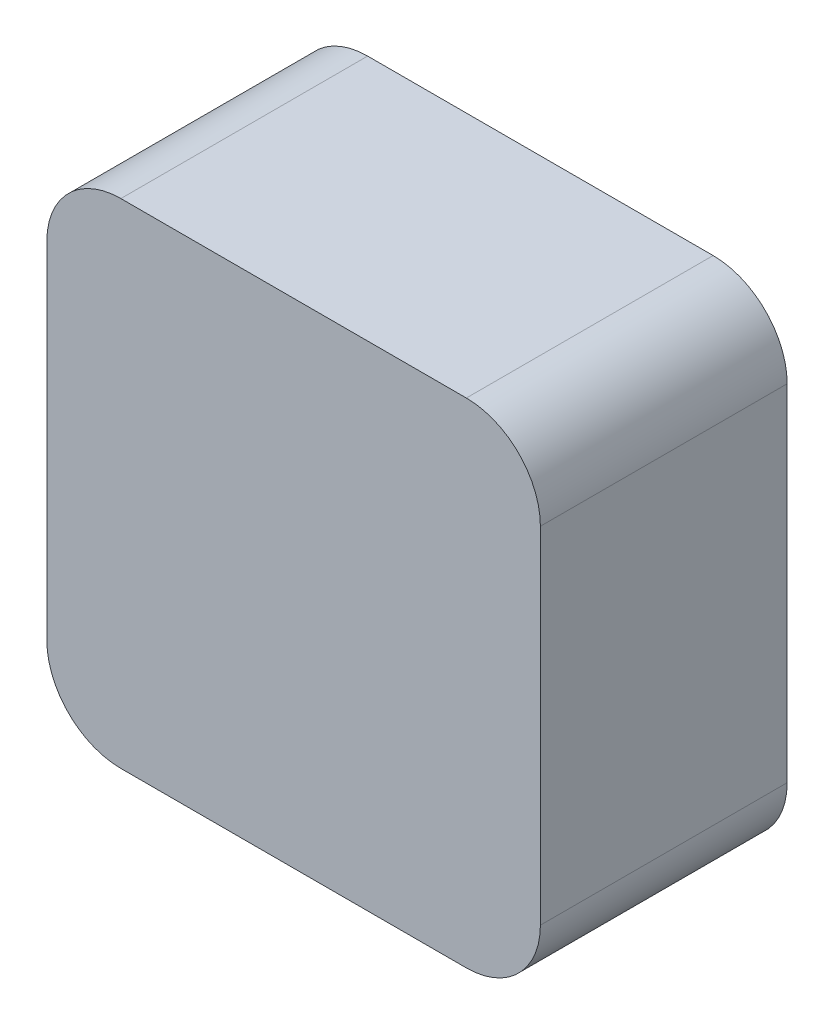
ISO-10303-21;
HEADER;
FILE_DESCRIPTION(('STEP AP214'),'2;1');
FILE_NAME('part.step','',(''),(''),'','','');
FILE_SCHEMA(('AUTOMOTIVE_DESIGN { 1 0 10303 214 1 1 1 1 }'));
ENDSEC;
DATA;
#1=APPLICATION_CONTEXT('core data for automotive mechanical design processes');
#2=APPLICATION_PROTOCOL_DEFINITION('international standard','automotive_design',2000,#1);
#3=PRODUCT_CONTEXT('',#1,'mechanical');
#4=PRODUCT('Part','Part','',(#3));
#5=PRODUCT_RELATED_PRODUCT_CATEGORY('part','',(#4));
#6=PRODUCT_DEFINITION_FORMATION('','',#4);
#7=PRODUCT_DEFINITION_CONTEXT('part definition',#1,'design');
#8=PRODUCT_DEFINITION('design','',#6,#7);
#9=PRODUCT_DEFINITION_SHAPE('','',#8);
#10=(LENGTH_UNIT() NAMED_UNIT(*) SI_UNIT(.MILLI.,.METRE.));
#11=(NAMED_UNIT(*) PLANE_ANGLE_UNIT() SI_UNIT($,.RADIAN.));
#12=(NAMED_UNIT(*) SI_UNIT($,.STERADIAN.) SOLID_ANGLE_UNIT());
#13=UNCERTAINTY_MEASURE_WITH_UNIT(LENGTH_MEASURE(1.E-05),#10,'distance_accuracy_value','');
#14=(GEOMETRIC_REPRESENTATION_CONTEXT(3) GLOBAL_UNCERTAINTY_ASSIGNED_CONTEXT((#13)) GLOBAL_UNIT_ASSIGNED_CONTEXT((#10,
#11,#12)) REPRESENTATION_CONTEXT('',''));
#15=CARTESIAN_POINT('',(0.,0.,0.));
#16=DIRECTION('',(0.,0.,1.));
#17=DIRECTION('',(1.,0.,0.));
#18=AXIS2_PLACEMENT_3D('',#15,#16,#17);
#19=CARTESIAN_POINT('',(0.,0.,5.));
#20=DIRECTION('',(0.,0.,1.));
#21=DIRECTION('',(1.,0.,0.));
#22=AXIS2_PLACEMENT_3D('',#19,#20,#21);
#23=PLANE('',#22);
#24=DIRECTION('',(0.,-1.,0.));
#25=VECTOR('',#24,1.);
#26=CARTESIAN_POINT('',(-145.000000000007,160.499999999999,5.));
#27=LINE('',#26,#25);
#28=CARTESIAN_POINT('',(-145.000000000007,158.999999999999,5.));
#29=VERTEX_POINT('',#28);
#30=CARTESIAN_POINT('',(-145.000000000007,151.999999999999,5.));
#31=VERTEX_POINT('',#30);
#32=EDGE_CURVE('E135',#29,#31,#27,.T.);
#33=ORIENTED_EDGE('',*,*,#32,.T.);
#34=CARTESIAN_POINT('',(-143.500000000007,151.999999999999,5.));
#35=DIRECTION('',(0.,0.,1.));
#36=DIRECTION('',(1.,0.,0.));
#37=AXIS2_PLACEMENT_3D('',#34,#35,#36);
#38=CIRCLE('',#37,1.5);
#39=CARTESIAN_POINT('',(-143.500000000007,150.499999999999,5.));
#40=VERTEX_POINT('',#39);
#41=EDGE_CURVE('E150',#31,#40,#38,.T.);
#42=ORIENTED_EDGE('',*,*,#41,.T.);
#43=DIRECTION('',(1.,0.,0.));
#44=VECTOR('',#43,1.);
#45=CARTESIAN_POINT('',(-145.000000000007,150.499999999999,5.));
#46=LINE('',#45,#44);
#47=CARTESIAN_POINT('',(-136.500000000007,150.499999999999,5.));
#48=VERTEX_POINT('',#47);
#49=EDGE_CURVE('E118',#40,#48,#46,.T.);
#50=ORIENTED_EDGE('',*,*,#49,.T.);
#51=CARTESIAN_POINT('',(-136.500000000007,151.999999999999,5.));
#52=DIRECTION('',(0.,0.,1.));
#53=DIRECTION('',(1.,0.,0.));
#54=AXIS2_PLACEMENT_3D('',#51,#52,#53);
#55=CIRCLE('',#54,1.5);
#56=CARTESIAN_POINT('',(-135.000000000007,151.999999999999,5.));
#57=VERTEX_POINT('',#56);
#58=EDGE_CURVE('E145',#48,#57,#55,.T.);
#59=ORIENTED_EDGE('',*,*,#58,.T.);
#60=DIRECTION('',(0.,1.,0.));
#61=VECTOR('',#60,1.);
#62=CARTESIAN_POINT('',(-135.000000000007,160.499999999999,5.));
#63=LINE('',#62,#61);
#64=CARTESIAN_POINT('',(-135.000000000007,158.999999999999,5.));
#65=VERTEX_POINT('',#64);
#66=EDGE_CURVE('E161',#57,#65,#63,.T.);
#67=ORIENTED_EDGE('',*,*,#66,.T.);
#68=CARTESIAN_POINT('',(-136.500000000007,158.999999999999,5.));
#69=DIRECTION('',(0.,0.,1.));
#70=DIRECTION('',(1.,0.,0.));
#71=AXIS2_PLACEMENT_3D('',#68,#69,#70);
#72=CIRCLE('',#71,1.5);
#73=CARTESIAN_POINT('',(-136.500000000007,160.499999999999,5.));
#74=VERTEX_POINT('',#73);
#75=EDGE_CURVE('E54',#65,#74,#72,.T.);
#76=ORIENTED_EDGE('',*,*,#75,.T.);
#77=DIRECTION('',(-1.,0.,0.));
#78=VECTOR('',#77,1.);
#79=CARTESIAN_POINT('',(-145.000000000007,160.499999999999,5.));
#80=LINE('',#79,#78);
#81=CARTESIAN_POINT('',(-143.500000000007,160.499999999999,5.));
#82=VERTEX_POINT('',#81);
#83=EDGE_CURVE('E136',#74,#82,#80,.T.);
#84=ORIENTED_EDGE('',*,*,#83,.T.);
#85=CARTESIAN_POINT('',(-143.500000000007,158.999999999999,5.));
#86=DIRECTION('',(0.,0.,1.));
#87=DIRECTION('',(1.,0.,0.));
#88=AXIS2_PLACEMENT_3D('',#85,#86,#87);
#89=CIRCLE('',#88,1.5);
#90=EDGE_CURVE('E148',#82,#29,#89,.T.);
#91=ORIENTED_EDGE('',*,*,#90,.T.);
#92=EDGE_LOOP('',(#33,#42,#50,#59,#67,#76,#84,#91));
#93=FACE_BOUND('',#92,.T.);
#94=ADVANCED_FACE('F32',(#93),#23,.T.);
#95=CARTESIAN_POINT('',(0.,0.,0.));
#96=DIRECTION('',(0.,0.,1.));
#97=DIRECTION('',(1.,0.,0.));
#98=AXIS2_PLACEMENT_3D('',#95,#96,#97);
#99=PLANE('',#98);
#100=CARTESIAN_POINT('',(-140.000000000007,155.499999999999,0.));
#101=DIRECTION('',(0.,0.,-1.));
#102=DIRECTION('',(-1.,0.,0.));
#103=AXIS2_PLACEMENT_3D('',#100,#101,#102);
#104=CIRCLE('',#103,2.25000000000001);
#105=CARTESIAN_POINT('',(-142.250000000007,155.499999999999,0.));
#106=VERTEX_POINT('',#105);
#107=EDGE_CURVE('E175',#106,#106,#104,.T.);
#108=ORIENTED_EDGE('',*,*,#107,.F.);
#109=EDGE_LOOP('',(#108));
#110=FACE_BOUND('',#109,.T.);
#111=DIRECTION('',(1.,0.,0.));
#112=VECTOR('',#111,1.);
#113=CARTESIAN_POINT('',(-145.000000000007,150.499999999999,0.));
#114=LINE('',#113,#112);
#115=CARTESIAN_POINT('',(-143.500000000007,150.499999999999,0.));
#116=VERTEX_POINT('',#115);
#117=CARTESIAN_POINT('',(-136.500000000007,150.499999999999,0.));
#118=VERTEX_POINT('',#117);
#119=EDGE_CURVE('E115',#116,#118,#114,.T.);
#120=ORIENTED_EDGE('',*,*,#119,.F.);
#121=CARTESIAN_POINT('',(-143.500000000007,151.999999999999,0.));
#122=DIRECTION('',(0.,0.,1.));
#123=DIRECTION('',(1.,0.,0.));
#124=AXIS2_PLACEMENT_3D('',#121,#122,#123);
#125=CIRCLE('',#124,1.5);
#126=CARTESIAN_POINT('',(-145.000000000007,151.999999999999,0.));
#127=VERTEX_POINT('',#126);
#128=EDGE_CURVE('E98',#116,#127,#125,.F.);
#129=ORIENTED_EDGE('',*,*,#128,.T.);
#130=DIRECTION('',(0.,-1.,0.));
#131=VECTOR('',#130,1.);
#132=CARTESIAN_POINT('',(-145.000000000007,160.499999999999,0.));
#133=LINE('',#132,#131);
#134=CARTESIAN_POINT('',(-145.000000000007,158.999999999999,0.));
#135=VERTEX_POINT('',#134);
#136=EDGE_CURVE('E125',#135,#127,#133,.T.);
#137=ORIENTED_EDGE('',*,*,#136,.F.);
#138=CARTESIAN_POINT('',(-143.500000000007,158.999999999999,0.));
#139=DIRECTION('',(0.,0.,1.));
#140=DIRECTION('',(1.,0.,0.));
#141=AXIS2_PLACEMENT_3D('',#138,#139,#140);
#142=CIRCLE('',#141,1.5);
#143=CARTESIAN_POINT('',(-143.500000000007,160.499999999999,0.));
#144=VERTEX_POINT('',#143);
#145=EDGE_CURVE('E109',#135,#144,#142,.F.);
#146=ORIENTED_EDGE('',*,*,#145,.T.);
#147=DIRECTION('',(-1.,0.,0.));
#148=VECTOR('',#147,1.);
#149=CARTESIAN_POINT('',(-145.000000000007,160.499999999999,0.));
#150=LINE('',#149,#148);
#151=CARTESIAN_POINT('',(-136.500000000007,160.499999999999,0.));
#152=VERTEX_POINT('',#151);
#153=EDGE_CURVE('E128',#152,#144,#150,.T.);
#154=ORIENTED_EDGE('',*,*,#153,.F.);
#155=CARTESIAN_POINT('',(-136.500000000007,158.999999999999,0.));
#156=DIRECTION('',(0.,0.,1.));
#157=DIRECTION('',(1.,0.,0.));
#158=AXIS2_PLACEMENT_3D('',#155,#156,#157);
#159=CIRCLE('',#158,1.5);
#160=CARTESIAN_POINT('',(-135.000000000007,158.999999999999,0.));
#161=VERTEX_POINT('',#160);
#162=EDGE_CURVE('E139',#152,#161,#159,.F.);
#163=ORIENTED_EDGE('',*,*,#162,.T.);
#164=DIRECTION('',(0.,1.,0.));
#165=VECTOR('',#164,1.);
#166=CARTESIAN_POINT('',(-135.000000000007,160.499999999999,0.));
#167=LINE('',#166,#165);
#168=CARTESIAN_POINT('',(-135.000000000007,151.999999999999,0.));
#169=VERTEX_POINT('',#168);
#170=EDGE_CURVE('E124',#169,#161,#167,.T.);
#171=ORIENTED_EDGE('',*,*,#170,.F.);
#172=CARTESIAN_POINT('',(-136.500000000007,151.999999999999,0.));
#173=DIRECTION('',(0.,0.,1.));
#174=DIRECTION('',(1.,0.,0.));
#175=AXIS2_PLACEMENT_3D('',#172,#173,#174);
#176=CIRCLE('',#175,1.5);
#177=EDGE_CURVE('E119',#169,#118,#176,.F.);
#178=ORIENTED_EDGE('',*,*,#177,.T.);
#179=EDGE_LOOP('',(#120,#129,#137,#146,#154,#163,#171,#178));
#180=FACE_BOUND('',#179,.T.);
#181=ADVANCED_FACE('F122',(#110,#180),#99,.F.);
#182=CARTESIAN_POINT('',(-145.000000000007,160.499999999999,5.));
#183=DIRECTION('',(1.,0.,0.));
#184=DIRECTION('',(0.,0.,-1.));
#185=AXIS2_PLACEMENT_3D('',#182,#183,#184);
#186=PLANE('',#185);
#187=ORIENTED_EDGE('',*,*,#136,.T.);
#188=DIRECTION('',(0.,0.,-1.));
#189=VECTOR('',#188,1.);
#190=CARTESIAN_POINT('',(-145.000000000007,151.999999999999,5.));
#191=LINE('',#190,#189);
#192=EDGE_CURVE('E103',#127,#31,#191,.F.);
#193=ORIENTED_EDGE('',*,*,#192,.T.);
#194=ORIENTED_EDGE('',*,*,#32,.F.);
#195=DIRECTION('',(0.,0.,-1.));
#196=VECTOR('',#195,1.);
#197=CARTESIAN_POINT('',(-145.000000000007,158.999999999999,5.));
#198=LINE('',#197,#196);
#199=EDGE_CURVE('E108',#29,#135,#198,.T.);
#200=ORIENTED_EDGE('',*,*,#199,.T.);
#201=EDGE_LOOP('',(#187,#193,#194,#200));
#202=FACE_BOUND('',#201,.T.);
#203=ADVANCED_FACE('F190',(#202),#186,.F.);
#204=CARTESIAN_POINT('',(-145.000000000007,150.499999999999,5.));
#205=DIRECTION('',(0.,1.,0.));
#206=DIRECTION('',(0.,0.,1.));
#207=AXIS2_PLACEMENT_3D('',#204,#205,#206);
#208=PLANE('',#207);
#209=ORIENTED_EDGE('',*,*,#49,.F.);
#210=DIRECTION('',(0.,0.,-1.));
#211=VECTOR('',#210,1.);
#212=CARTESIAN_POINT('',(-143.500000000007,150.499999999999,5.));
#213=LINE('',#212,#211);
#214=EDGE_CURVE('E102',#40,#116,#213,.T.);
#215=ORIENTED_EDGE('',*,*,#214,.T.);
#216=ORIENTED_EDGE('',*,*,#119,.T.);
#217=DIRECTION('',(0.,0.,-1.));
#218=VECTOR('',#217,1.);
#219=CARTESIAN_POINT('',(-136.500000000007,150.499999999999,5.));
#220=LINE('',#219,#218);
#221=EDGE_CURVE('E120',#118,#48,#220,.F.);
#222=ORIENTED_EDGE('',*,*,#221,.T.);
#223=EDGE_LOOP('',(#209,#215,#216,#222));
#224=FACE_BOUND('',#223,.T.);
#225=ADVANCED_FACE('F114',(#224),#208,.F.);
#226=CARTESIAN_POINT('',(-135.000000000007,160.499999999999,5.));
#227=DIRECTION('',(-1.,0.,0.));
#228=DIRECTION('',(0.,0.,1.));
#229=AXIS2_PLACEMENT_3D('',#226,#227,#228);
#230=PLANE('',#229);
#231=ORIENTED_EDGE('',*,*,#170,.T.);
#232=DIRECTION('',(0.,0.,-1.));
#233=VECTOR('',#232,1.);
#234=CARTESIAN_POINT('',(-135.000000000007,158.999999999999,5.));
#235=LINE('',#234,#233);
#236=EDGE_CURVE('E11',#161,#65,#235,.F.);
#237=ORIENTED_EDGE('',*,*,#236,.T.);
#238=ORIENTED_EDGE('',*,*,#66,.F.);
#239=DIRECTION('',(0.,0.,-1.));
#240=VECTOR('',#239,1.);
#241=CARTESIAN_POINT('',(-135.000000000007,151.999999999999,5.));
#242=LINE('',#241,#240);
#243=EDGE_CURVE('E40',#57,#169,#242,.T.);
#244=ORIENTED_EDGE('',*,*,#243,.T.);
#245=EDGE_LOOP('',(#231,#237,#238,#244));
#246=FACE_BOUND('',#245,.T.);
#247=ADVANCED_FACE('F159',(#246),#230,.F.);
#248=CARTESIAN_POINT('',(-145.000000000007,160.499999999999,5.));
#249=DIRECTION('',(0.,-1.,0.));
#250=DIRECTION('',(0.,0.,-1.));
#251=AXIS2_PLACEMENT_3D('',#248,#249,#250);
#252=PLANE('',#251);
#253=ORIENTED_EDGE('',*,*,#153,.T.);
#254=DIRECTION('',(0.,0.,-1.));
#255=VECTOR('',#254,1.);
#256=CARTESIAN_POINT('',(-143.500000000007,160.499999999999,5.));
#257=LINE('',#256,#255);
#258=EDGE_CURVE('E47',#144,#82,#257,.F.);
#259=ORIENTED_EDGE('',*,*,#258,.T.);
#260=ORIENTED_EDGE('',*,*,#83,.F.);
#261=DIRECTION('',(0.,0.,-1.));
#262=VECTOR('',#261,1.);
#263=CARTESIAN_POINT('',(-136.500000000007,160.499999999999,5.));
#264=LINE('',#263,#262);
#265=EDGE_CURVE('E152',#74,#152,#264,.T.);
#266=ORIENTED_EDGE('',*,*,#265,.T.);
#267=EDGE_LOOP('',(#253,#259,#260,#266));
#268=FACE_BOUND('',#267,.T.);
#269=ADVANCED_FACE('F168',(#268),#252,.F.);
#270=CARTESIAN_POINT('',(-143.500000000007,151.999999999999,5.));
#271=DIRECTION('',(0.,0.,-1.));
#272=DIRECTION('',(-1.,0.,0.));
#273=AXIS2_PLACEMENT_3D('',#270,#271,#272);
#274=CYLINDRICAL_SURFACE('',#273,1.5);
#275=ORIENTED_EDGE('',*,*,#41,.F.);
#276=ORIENTED_EDGE('',*,*,#192,.F.);
#277=ORIENTED_EDGE('',*,*,#128,.F.);
#278=ORIENTED_EDGE('',*,*,#214,.F.);
#279=EDGE_LOOP('',(#275,#276,#277,#278));
#280=FACE_BOUND('',#279,.T.);
#281=ADVANCED_FACE('F101',(#280),#274,.T.);
#282=CARTESIAN_POINT('',(-143.500000000007,158.999999999999,5.));
#283=DIRECTION('',(0.,0.,-1.));
#284=DIRECTION('',(-1.,0.,0.));
#285=AXIS2_PLACEMENT_3D('',#282,#283,#284);
#286=CYLINDRICAL_SURFACE('',#285,1.5);
#287=ORIENTED_EDGE('',*,*,#90,.F.);
#288=ORIENTED_EDGE('',*,*,#258,.F.);
#289=ORIENTED_EDGE('',*,*,#145,.F.);
#290=ORIENTED_EDGE('',*,*,#199,.F.);
#291=EDGE_LOOP('',(#287,#288,#289,#290));
#292=FACE_BOUND('',#291,.T.);
#293=ADVANCED_FACE('F209',(#292),#286,.T.);
#294=CARTESIAN_POINT('',(-136.500000000007,158.999999999999,5.));
#295=DIRECTION('',(0.,0.,-1.));
#296=DIRECTION('',(-1.,0.,0.));
#297=AXIS2_PLACEMENT_3D('',#294,#295,#296);
#298=CYLINDRICAL_SURFACE('',#297,1.5);
#299=ORIENTED_EDGE('',*,*,#75,.F.);
#300=ORIENTED_EDGE('',*,*,#236,.F.);
#301=ORIENTED_EDGE('',*,*,#162,.F.);
#302=ORIENTED_EDGE('',*,*,#265,.F.);
#303=EDGE_LOOP('',(#299,#300,#301,#302));
#304=FACE_BOUND('',#303,.T.);
#305=ADVANCED_FACE('F167',(#304),#298,.T.);
#306=CARTESIAN_POINT('',(-136.500000000007,151.999999999999,5.));
#307=DIRECTION('',(0.,0.,-1.));
#308=DIRECTION('',(-1.,0.,0.));
#309=AXIS2_PLACEMENT_3D('',#306,#307,#308);
#310=CYLINDRICAL_SURFACE('',#309,1.5);
#311=ORIENTED_EDGE('',*,*,#58,.F.);
#312=ORIENTED_EDGE('',*,*,#221,.F.);
#313=ORIENTED_EDGE('',*,*,#177,.F.);
#314=ORIENTED_EDGE('',*,*,#243,.F.);
#315=EDGE_LOOP('',(#311,#312,#313,#314));
#316=FACE_BOUND('',#315,.T.);
#317=ADVANCED_FACE('F34',(#316),#310,.T.);
#318=CARTESIAN_POINT('',(-140.000000000007,155.499999999999,4.));
#319=DIRECTION('',(0.,0.,-1.));
#320=DIRECTION('',(-1.,0.,0.));
#321=AXIS2_PLACEMENT_3D('',#318,#319,#320);
#322=CYLINDRICAL_SURFACE('',#321,2.25000000000001);
#323=CARTESIAN_POINT('',(-140.000000000007,155.499999999999,4.));
#324=DIRECTION('',(0.,0.,-1.));
#325=DIRECTION('',(-1.,0.,0.));
#326=AXIS2_PLACEMENT_3D('',#323,#324,#325);
#327=CIRCLE('',#326,2.25000000000001);
#328=CARTESIAN_POINT('',(-142.250000000007,155.499999999999,4.));
#329=VERTEX_POINT('',#328);
#330=EDGE_CURVE('E130',#329,#329,#327,.T.);
#331=ORIENTED_EDGE('',*,*,#330,.F.);
#332=EDGE_LOOP('',(#331));
#333=FACE_BOUND('',#332,.T.);
#334=ORIENTED_EDGE('',*,*,#107,.T.);
#335=EDGE_LOOP('',(#334));
#336=FACE_BOUND('',#335,.T.);
#337=ADVANCED_FACE('F183',(#333,#336),#322,.F.);
#338=CARTESIAN_POINT('',(-140.000000000007,155.499999999999,4.));
#339=DIRECTION('',(0.,0.,1.));
#340=DIRECTION('',(1.,0.,0.));
#341=AXIS2_PLACEMENT_3D('',#338,#339,#340);
#342=PLANE('',#341);
#343=ORIENTED_EDGE('',*,*,#330,.T.);
#344=EDGE_LOOP('',(#343));
#345=FACE_BOUND('',#344,.T.);
#346=ADVANCED_FACE('F181',(#345),#342,.F.);
#347=CLOSED_SHELL('',(#94,#181,#203,#225,#247,#269,#281,#293,#305,#317,#337,#346));
#348=MANIFOLD_SOLID_BREP('B2',#347);
#349=ADVANCED_BREP_SHAPE_REPRESENTATION('',(#18,#348),#14);
#350=SHAPE_DEFINITION_REPRESENTATION(#9,#349);
ENDSEC;
END-ISO-10303-21;
